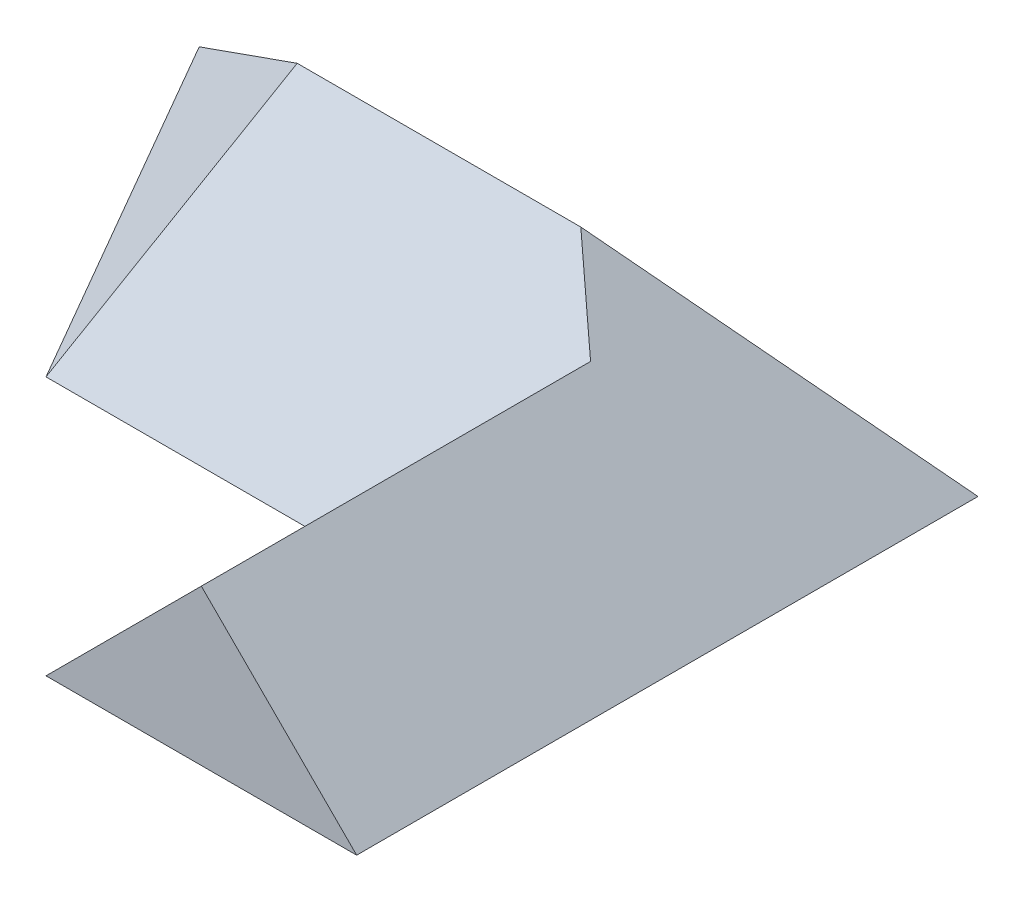
ISO-10303-21;
HEADER;
FILE_DESCRIPTION(('STEP AP214'),'2;1');
FILE_NAME('part.step','',(''),(''),'','','');
FILE_SCHEMA(('AUTOMOTIVE_DESIGN { 1 0 10303 214 1 1 1 1 }'));
ENDSEC;
DATA;
#1=APPLICATION_CONTEXT('core data for automotive mechanical design processes');
#2=APPLICATION_PROTOCOL_DEFINITION('international standard','automotive_design',2000,#1);
#3=PRODUCT_CONTEXT('',#1,'mechanical');
#4=PRODUCT('Part','Part','',(#3));
#5=PRODUCT_RELATED_PRODUCT_CATEGORY('part','',(#4));
#6=PRODUCT_DEFINITION_FORMATION('','',#4);
#7=PRODUCT_DEFINITION_CONTEXT('part definition',#1,'design');
#8=PRODUCT_DEFINITION('design','',#6,#7);
#9=PRODUCT_DEFINITION_SHAPE('','',#8);
#10=(LENGTH_UNIT() NAMED_UNIT(*) SI_UNIT(.MILLI.,.METRE.));
#11=(NAMED_UNIT(*) PLANE_ANGLE_UNIT() SI_UNIT($,.RADIAN.));
#12=(NAMED_UNIT(*) SI_UNIT($,.STERADIAN.) SOLID_ANGLE_UNIT());
#13=UNCERTAINTY_MEASURE_WITH_UNIT(LENGTH_MEASURE(1.E-05),#10,'distance_accuracy_value','');
#14=(GEOMETRIC_REPRESENTATION_CONTEXT(3) GLOBAL_UNCERTAINTY_ASSIGNED_CONTEXT((#13)) GLOBAL_UNIT_ASSIGNED_CONTEXT((#10,
#11,#12)) REPRESENTATION_CONTEXT('',''));
#15=CARTESIAN_POINT('',(0.,0.,0.));
#16=DIRECTION('',(0.,0.,1.));
#17=DIRECTION('',(1.,0.,0.));
#18=AXIS2_PLACEMENT_3D('',#15,#16,#17);
#19=CARTESIAN_POINT('',(-110.,41.7113757407969,-85.));
#20=DIRECTION('',(0.,0.642787609686544,-0.766044443118974));
#21=DIRECTION('',(0.,0.766044443118974,0.642787609686544));
#22=AXIS2_PLACEMENT_3D('',#19,#20,#21);
#23=PLANE('',#22);
#24=DIRECTION('',(1.,0.,0.));
#25=VECTOR('',#24,1.);
#26=CARTESIAN_POINT('',(-60.,0.,-120.));
#27=LINE('',#26,#25);
#28=CARTESIAN_POINT('',(-110.,0.,-120.));
#29=VERTEX_POINT('',#28);
#30=CARTESIAN_POINT('',(0.,0.,-120.));
#31=VERTEX_POINT('',#30);
#32=EDGE_CURVE('E95',#29,#31,#27,.T.);
#33=ORIENTED_EDGE('',*,*,#32,.F.);
#34=DIRECTION('',(-1.,0.,0.));
#35=VECTOR('',#34,1.);
#36=CARTESIAN_POINT('',(-110.,0.,-120.));
#37=LINE('',#36,#35);
#38=CARTESIAN_POINT('',(-150.414518843273,0.,-120.));
#39=VERTEX_POINT('',#38);
#40=EDGE_CURVE('E92',#29,#39,#37,.T.);
#41=ORIENTED_EDGE('',*,*,#40,.T.);
#42=DIRECTION('',(0.703718072063221,0.544258740915316,0.456687308767058));
#43=VECTOR('',#42,1.);
#44=CARTESIAN_POINT('',(-103.176553803444,36.5340558905944,-89.3442871767918));
#45=LINE('',#44,#43);
#46=CARTESIAN_POINT('',(-96.482359903477,41.7113757407969,-85.));
#47=VERTEX_POINT('',#46);
#48=EDGE_CURVE('E167',#39,#47,#45,.T.);
#49=ORIENTED_EDGE('',*,*,#48,.T.);
#50=DIRECTION('',(1.,0.,0.));
#51=VECTOR('',#50,1.);
#52=CARTESIAN_POINT('',(-110.,41.7113757407969,-85.));
#53=LINE('',#52,#51);
#54=CARTESIAN_POINT('',(-41.7113757407973,41.7113757407969,-85.));
#55=VERTEX_POINT('',#54);
#56=EDGE_CURVE('E169',#47,#55,#53,.T.);
#57=ORIENTED_EDGE('',*,*,#56,.T.);
#58=DIRECTION('',(-0.608120402411345,0.608120402411338,0.510273605374739));
#59=VECTOR('',#58,1.);
#60=CARTESIAN_POINT('',(-66.9652208207881,66.9652208207873,-63.8095079075716));
#61=LINE('',#60,#59);
#62=EDGE_CURVE('E106',#31,#55,#61,.T.);
#63=ORIENTED_EDGE('',*,*,#62,.F.);
#64=EDGE_LOOP('',(#33,#41,#49,#57,#63));
#65=FACE_BOUND('',#64,.T.);
#66=ADVANCED_FACE('F36',(#65),#23,.T.);
#67=CARTESIAN_POINT('',(-110.,0.,-50.));
#68=DIRECTION('',(0.,0.642787609686544,0.766044443118974));
#69=DIRECTION('',(0.,-0.766044443118974,0.642787609686544));
#70=AXIS2_PLACEMENT_3D('',#67,#68,#69);
#71=PLANE('',#70);
#72=ORIENTED_EDGE('',*,*,#56,.F.);
#73=DIRECTION('',(-0.24094254527317,-0.74347629956639,0.623850688755214));
#74=VECTOR('',#73,1.);
#75=CARTESIAN_POINT('',(-110.,0.,-50.));
#76=LINE('',#75,#74);
#77=CARTESIAN_POINT('',(-110.,0.,-50.));
#78=VERTEX_POINT('',#77);
#79=EDGE_CURVE('E101',#47,#78,#76,.T.);
#80=ORIENTED_EDGE('',*,*,#79,.T.);
#81=DIRECTION('',(1.,0.,0.));
#82=VECTOR('',#81,1.);
#83=CARTESIAN_POINT('',(-110.,0.,-50.));
#84=LINE('',#83,#82);
#85=CARTESIAN_POINT('',(-60.,0.,-50.));
#86=VERTEX_POINT('',#85);
#87=EDGE_CURVE('E171',#78,#86,#84,.T.);
#88=ORIENTED_EDGE('',*,*,#87,.T.);
#89=DIRECTION('',(0.608120402411345,0.608120402411339,-0.510273605374739));
#90=VECTOR('',#89,1.);
#91=CARTESIAN_POINT('',(-16.0898292534378,43.9101707465617,-86.8450080783717));
#92=LINE('',#91,#90);
#93=CARTESIAN_POINT('',(-30.,29.9999999999997,-75.1729889353184));
#94=VERTEX_POINT('',#93);
#95=EDGE_CURVE('E154',#86,#94,#92,.T.);
#96=ORIENTED_EDGE('',*,*,#95,.T.);
#97=DIRECTION('',(0.608120402411345,-0.608120402411338,0.510273605374739));
#98=VECTOR('',#97,1.);
#99=CARTESIAN_POINT('',(-40.679146621183,40.6791466211826,-84.1338569264412));
#100=LINE('',#99,#98);
#101=EDGE_CURVE('E165',#55,#94,#100,.T.);
#102=ORIENTED_EDGE('',*,*,#101,.F.);
#103=EDGE_LOOP('',(#72,#80,#88,#96,#102));
#104=FACE_BOUND('',#103,.T.);
#105=ADVANCED_FACE('F136',(#104),#71,.T.);
#106=CARTESIAN_POINT('',(-60.,0.,-120.));
#107=DIRECTION('',(0.,-1.,0.));
#108=DIRECTION('',(0.,0.,-1.));
#109=AXIS2_PLACEMENT_3D('',#106,#107,#108);
#110=PLANE('',#109);
#111=DIRECTION('',(0.,0.,1.));
#112=VECTOR('',#111,1.);
#113=CARTESIAN_POINT('',(-60.,0.,-120.));
#114=LINE('',#113,#112);
#115=CARTESIAN_POINT('',(-60.,0.,0.));
#116=VERTEX_POINT('',#115);
#117=EDGE_CURVE('E12',#86,#116,#114,.T.);
#118=ORIENTED_EDGE('',*,*,#117,.F.);
#119=ORIENTED_EDGE('',*,*,#87,.F.);
#120=DIRECTION('',(0.499999999999995,0.,0.866025403784442));
#121=VECTOR('',#120,1.);
#122=CARTESIAN_POINT('',(-150.414518843273,0.,-120.));
#123=LINE('',#122,#121);
#124=EDGE_CURVE('E97',#39,#78,#123,.T.);
#125=ORIENTED_EDGE('',*,*,#124,.F.);
#126=ORIENTED_EDGE('',*,*,#40,.F.);
#127=ORIENTED_EDGE('',*,*,#32,.T.);
#128=DIRECTION('',(0.,0.,1.));
#129=VECTOR('',#128,1.);
#130=CARTESIAN_POINT('',(0.,0.,-120.));
#131=LINE('',#130,#129);
#132=CARTESIAN_POINT('',(0.,0.,0.));
#133=VERTEX_POINT('',#132);
#134=EDGE_CURVE('E108',#31,#133,#131,.T.);
#135=ORIENTED_EDGE('',*,*,#134,.T.);
#136=DIRECTION('',(1.,0.,0.));
#137=VECTOR('',#136,1.);
#138=CARTESIAN_POINT('',(-60.,0.,0.));
#139=LINE('',#138,#137);
#140=EDGE_CURVE('E153',#116,#133,#139,.T.);
#141=ORIENTED_EDGE('',*,*,#140,.F.);
#142=EDGE_LOOP('',(#118,#119,#125,#126,#127,#135,#141));
#143=FACE_BOUND('',#142,.T.);
#144=ADVANCED_FACE('F38',(#143),#110,.T.);
#145=CARTESIAN_POINT('',(-30.,29.9999999999997,-120.));
#146=DIRECTION('',(-0.707106781186544,0.707106781186551,0.));
#147=DIRECTION('',(-0.707106781186551,-0.707106781186544,0.));
#148=AXIS2_PLACEMENT_3D('',#145,#146,#147);
#149=PLANE('',#148);
#150=ORIENTED_EDGE('',*,*,#95,.F.);
#151=ORIENTED_EDGE('',*,*,#117,.T.);
#152=DIRECTION('',(-0.707106781186551,-0.707106781186544,0.));
#153=VECTOR('',#152,1.);
#154=CARTESIAN_POINT('',(-30.,29.9999999999997,0.));
#155=LINE('',#154,#153);
#156=CARTESIAN_POINT('',(-30.,29.9999999999997,0.));
#157=VERTEX_POINT('',#156);
#158=EDGE_CURVE('E109',#157,#116,#155,.T.);
#159=ORIENTED_EDGE('',*,*,#158,.F.);
#160=DIRECTION('',(0.,0.,1.));
#161=VECTOR('',#160,1.);
#162=CARTESIAN_POINT('',(-30.,29.9999999999997,-120.));
#163=LINE('',#162,#161);
#164=EDGE_CURVE('E48',#94,#157,#163,.T.);
#165=ORIENTED_EDGE('',*,*,#164,.F.);
#166=EDGE_LOOP('',(#150,#151,#159,#165));
#167=FACE_BOUND('',#166,.T.);
#168=ADVANCED_FACE('F146',(#167),#149,.T.);
#169=CARTESIAN_POINT('',(0.,0.,-120.));
#170=DIRECTION('',(0.707106781186544,0.707106781186551,0.));
#171=DIRECTION('',(-0.707106781186551,0.707106781186544,0.));
#172=AXIS2_PLACEMENT_3D('',#169,#170,#171);
#173=PLANE('',#172);
#174=ORIENTED_EDGE('',*,*,#134,.F.);
#175=ORIENTED_EDGE('',*,*,#62,.T.);
#176=ORIENTED_EDGE('',*,*,#101,.T.);
#177=ORIENTED_EDGE('',*,*,#164,.T.);
#178=DIRECTION('',(-0.707106781186551,0.707106781186544,0.));
#179=VECTOR('',#178,1.);
#180=CARTESIAN_POINT('',(0.,0.,0.));
#181=LINE('',#180,#179);
#182=EDGE_CURVE('E113',#133,#157,#181,.T.);
#183=ORIENTED_EDGE('',*,*,#182,.F.);
#184=EDGE_LOOP('',(#174,#175,#176,#177,#183));
#185=FACE_BOUND('',#184,.T.);
#186=ADVANCED_FACE('F144',(#185),#173,.T.);
#187=CARTESIAN_POINT('',(0.,0.,0.));
#188=DIRECTION('',(0.,0.,1.));
#189=DIRECTION('',(1.,0.,0.));
#190=AXIS2_PLACEMENT_3D('',#187,#188,#189);
#191=PLANE('',#190);
#192=ORIENTED_EDGE('',*,*,#140,.T.);
#193=ORIENTED_EDGE('',*,*,#182,.T.);
#194=ORIENTED_EDGE('',*,*,#158,.T.);
#195=EDGE_LOOP('',(#192,#193,#194));
#196=FACE_BOUND('',#195,.T.);
#197=ADVANCED_FACE('F135',(#196),#191,.T.);
#198=CARTESIAN_POINT('',(-109.480180640187,50.8424056468427,-120.300117847318));
#199=DIRECTION('',(-0.709406479916223,0.57357643635105,0.40957602214449));
#200=DIRECTION('',(-0.628731263987388,-0.777622657646253,0.));
#201=AXIS2_PLACEMENT_3D('',#198,#199,#200);
#202=PLANE('',#201);
#203=ORIENTED_EDGE('',*,*,#48,.F.);
#204=ORIENTED_EDGE('',*,*,#124,.T.);
#205=ORIENTED_EDGE('',*,*,#79,.F.);
#206=EDGE_LOOP('',(#203,#204,#205));
#207=FACE_BOUND('',#206,.T.);
#208=ADVANCED_FACE('F126',(#207),#202,.T.);
#209=CLOSED_SHELL('',(#66,#105,#144,#168,#186,#197,#208));
#210=MANIFOLD_SOLID_BREP('B2',#209);
#211=ADVANCED_BREP_SHAPE_REPRESENTATION('',(#18,#210),#14);
#212=SHAPE_DEFINITION_REPRESENTATION(#9,#211);
ENDSEC;
END-ISO-10303-21;
